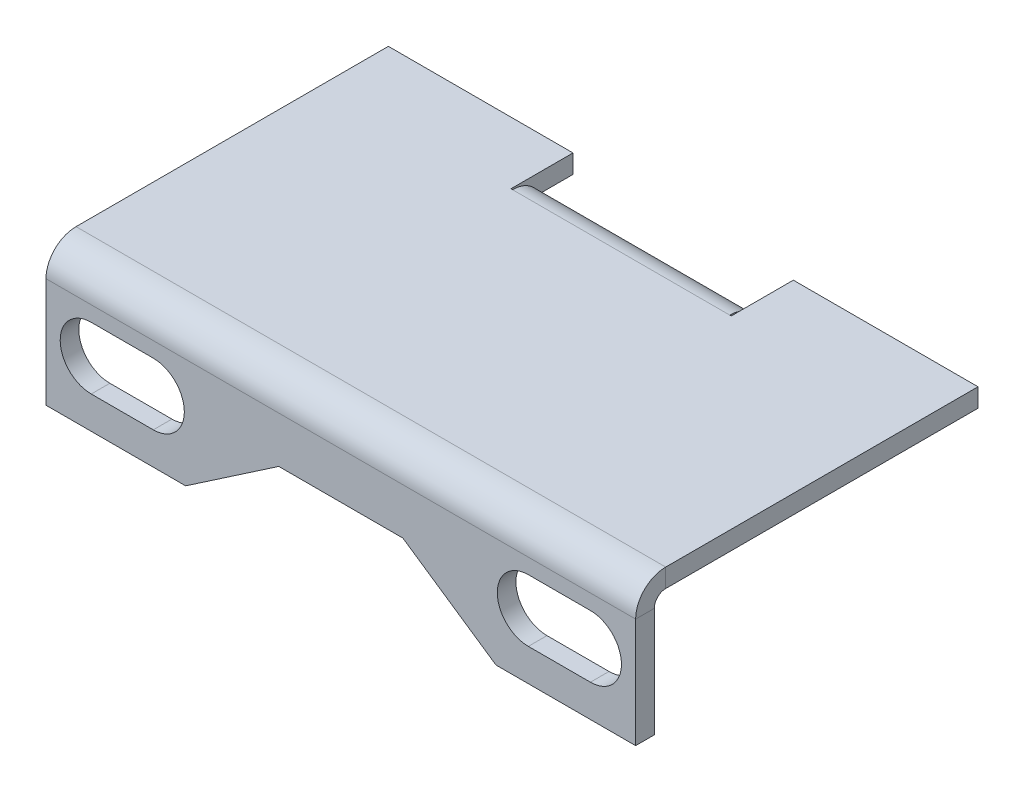
ISO-10303-21;
HEADER;
FILE_DESCRIPTION(('STEP AP214'),'2;1');
FILE_NAME('part.step','',(''),(''),'','','');
FILE_SCHEMA(('AUTOMOTIVE_DESIGN { 1 0 10303 214 1 1 1 1 }'));
ENDSEC;
DATA;
#1=APPLICATION_CONTEXT('core data for automotive mechanical design processes');
#2=APPLICATION_PROTOCOL_DEFINITION('international standard','automotive_design',2000,#1);
#3=PRODUCT_CONTEXT('',#1,'mechanical');
#4=PRODUCT('Part','Part','',(#3));
#5=PRODUCT_RELATED_PRODUCT_CATEGORY('part','',(#4));
#6=PRODUCT_DEFINITION_FORMATION('','',#4);
#7=PRODUCT_DEFINITION_CONTEXT('part definition',#1,'design');
#8=PRODUCT_DEFINITION('design','',#6,#7);
#9=PRODUCT_DEFINITION_SHAPE('','',#8);
#10=(LENGTH_UNIT() NAMED_UNIT(*) SI_UNIT(.MILLI.,.METRE.));
#11=(NAMED_UNIT(*) PLANE_ANGLE_UNIT() SI_UNIT($,.RADIAN.));
#12=(NAMED_UNIT(*) SI_UNIT($,.STERADIAN.) SOLID_ANGLE_UNIT());
#13=UNCERTAINTY_MEASURE_WITH_UNIT(LENGTH_MEASURE(1.E-05),#10,'distance_accuracy_value','');
#14=(GEOMETRIC_REPRESENTATION_CONTEXT(3) GLOBAL_UNCERTAINTY_ASSIGNED_CONTEXT((#13)) GLOBAL_UNIT_ASSIGNED_CONTEXT((#10,
#11,#12)) REPRESENTATION_CONTEXT('',''));
#15=CARTESIAN_POINT('',(0.,0.,0.));
#16=DIRECTION('',(0.,0.,1.));
#17=DIRECTION('',(1.,0.,0.));
#18=AXIS2_PLACEMENT_3D('',#15,#16,#17);
#19=CARTESIAN_POINT('',(19.,19.0000000000001,-20.));
#20=DIRECTION('',(-1.,0.,0.));
#21=DIRECTION('',(0.,0.,1.));
#22=AXIS2_PLACEMENT_3D('',#19,#20,#21);
#23=PLANE('',#22);
#24=DIRECTION('',(0.,0.,1.));
#25=VECTOR('',#24,1.);
#26=CARTESIAN_POINT('',(18.9999999999999,17.8000000000001,-20.));
#27=LINE('',#26,#25);
#28=CARTESIAN_POINT('',(18.9999999999999,17.8,-1.93659999999999));
#29=VERTEX_POINT('',#28);
#30=CARTESIAN_POINT('',(19.,17.8000000000001,-22.0634));
#31=VERTEX_POINT('',#30);
#32=EDGE_CURVE('E289',#29,#31,#27,.F.);
#33=ORIENTED_EDGE('',*,*,#32,.T.);
#34=DIRECTION('',(0.,1.,0.));
#35=VECTOR('',#34,1.);
#36=CARTESIAN_POINT('',(19.,5.24571786202021,-22.0634000000001));
#37=LINE('',#36,#35);
#38=CARTESIAN_POINT('',(19.,19.0000000000001,-22.0634));
#39=VERTEX_POINT('',#38);
#40=EDGE_CURVE('E292',#31,#39,#37,.T.);
#41=ORIENTED_EDGE('',*,*,#40,.T.);
#42=DIRECTION('',(0.,0.,-1.));
#43=VECTOR('',#42,1.);
#44=CARTESIAN_POINT('',(19.,19.,0.));
#45=LINE('',#44,#43);
#46=CARTESIAN_POINT('',(19.,19.,-1.93660000000001));
#47=VERTEX_POINT('',#46);
#48=EDGE_CURVE('E608',#47,#39,#45,.T.);
#49=ORIENTED_EDGE('',*,*,#48,.F.);
#50=DIRECTION('',(0.,1.,0.));
#51=VECTOR('',#50,1.);
#52=CARTESIAN_POINT('',(18.9999999999999,17.8,-1.93660000000001));
#53=LINE('',#52,#51);
#54=EDGE_CURVE('E295',#29,#47,#53,.T.);
#55=ORIENTED_EDGE('',*,*,#54,.F.);
#56=EDGE_LOOP('',(#33,#41,#49,#55));
#57=FACE_BOUND('',#56,.T.);
#58=ADVANCED_FACE('F92',(#57),#23,.F.);
#59=CARTESIAN_POINT('',(-19.,19.,-1.20000000000001));
#60=DIRECTION('',(1.,0.,0.));
#61=DIRECTION('',(0.,0.,-1.));
#62=AXIS2_PLACEMENT_3D('',#59,#60,#61);
#63=PLANE('',#62);
#64=DIRECTION('',(0.,0.,1.));
#65=VECTOR('',#64,1.);
#66=CARTESIAN_POINT('',(-19.,19.,0.));
#67=LINE('',#66,#65);
#68=CARTESIAN_POINT('',(-19.,19.0000000000001,-22.0634));
#69=VERTEX_POINT('',#68);
#70=CARTESIAN_POINT('',(-19.,19.,-1.93660000000001));
#71=VERTEX_POINT('',#70);
#72=EDGE_CURVE('E604',#69,#71,#67,.T.);
#73=ORIENTED_EDGE('',*,*,#72,.F.);
#74=DIRECTION('',(0.,1.,0.));
#75=VECTOR('',#74,1.);
#76=CARTESIAN_POINT('',(-19.0000000000001,5.24571786202021,-22.0634000000001));
#77=LINE('',#76,#75);
#78=CARTESIAN_POINT('',(-19.,17.8000000000001,-22.0634));
#79=VERTEX_POINT('',#78);
#80=EDGE_CURVE('E337',#79,#69,#77,.T.);
#81=ORIENTED_EDGE('',*,*,#80,.F.);
#82=DIRECTION('',(0.,0.,-1.));
#83=VECTOR('',#82,1.);
#84=CARTESIAN_POINT('',(-19.,17.8,-1.20000000000001));
#85=LINE('',#84,#83);
#86=CARTESIAN_POINT('',(-19.0000000000001,17.8,-1.93660000000001));
#87=VERTEX_POINT('',#86);
#88=EDGE_CURVE('E300',#79,#87,#85,.F.);
#89=ORIENTED_EDGE('',*,*,#88,.T.);
#90=DIRECTION('',(0.,1.,0.));
#91=VECTOR('',#90,1.);
#92=CARTESIAN_POINT('',(-19.,19.,-1.93660000000001));
#93=LINE('',#92,#91);
#94=EDGE_CURVE('E15',#87,#71,#93,.T.);
#95=ORIENTED_EDGE('',*,*,#94,.T.);
#96=EDGE_LOOP('',(#73,#81,#89,#95));
#97=FACE_BOUND('',#96,.T.);
#98=ADVANCED_FACE('F702',(#97),#63,.F.);
#99=CARTESIAN_POINT('',(0.,19.,0.));
#100=DIRECTION('',(0.,-1.,0.));
#101=DIRECTION('',(0.,0.,-1.));
#102=AXIS2_PLACEMENT_3D('',#99,#100,#101);
#103=PLANE('',#102);
#104=ORIENTED_EDGE('',*,*,#48,.T.);
#105=DIRECTION('',(-1.,0.,0.));
#106=VECTOR('',#105,1.);
#107=CARTESIAN_POINT('',(19.,19.0000000000001,-22.0634));
#108=LINE('',#107,#106);
#109=CARTESIAN_POINT('',(7.1,19.0000000000001,-22.0634));
#110=VERTEX_POINT('',#109);
#111=EDGE_CURVE('E313',#39,#110,#108,.T.);
#112=ORIENTED_EDGE('',*,*,#111,.T.);
#113=DIRECTION('',(0.,0.,1.));
#114=VECTOR('',#113,1.);
#115=CARTESIAN_POINT('',(7.1,19.,-18.0634));
#116=LINE('',#115,#114);
#117=CARTESIAN_POINT('',(7.1,19.,-18.0634));
#118=VERTEX_POINT('',#117);
#119=EDGE_CURVE('E315',#110,#118,#116,.T.);
#120=ORIENTED_EDGE('',*,*,#119,.T.);
#121=DIRECTION('',(-1.,0.,0.));
#122=VECTOR('',#121,1.);
#123=CARTESIAN_POINT('',(19.,19.,-18.0634));
#124=LINE('',#123,#122);
#125=CARTESIAN_POINT('',(6.99999999999999,19.,-18.0634));
#126=VERTEX_POINT('',#125);
#127=EDGE_CURVE('E618',#118,#126,#124,.T.);
#128=ORIENTED_EDGE('',*,*,#127,.T.);
#129=DIRECTION('',(-1.,0.,0.));
#130=VECTOR('',#129,1.);
#131=CARTESIAN_POINT('',(19.,19.,-18.0634));
#132=LINE('',#131,#130);
#133=CARTESIAN_POINT('',(-7.,19.0000000000001,-18.0634));
#134=VERTEX_POINT('',#133);
#135=EDGE_CURVE('E621',#126,#134,#132,.T.);
#136=ORIENTED_EDGE('',*,*,#135,.T.);
#137=DIRECTION('',(1.,0.,0.));
#138=VECTOR('',#137,1.);
#139=CARTESIAN_POINT('',(-19.,19.,-18.0634));
#140=LINE('',#139,#138);
#141=CARTESIAN_POINT('',(-7.1,19.,-18.0634));
#142=VERTEX_POINT('',#141);
#143=EDGE_CURVE('E301',#142,#134,#140,.T.);
#144=ORIENTED_EDGE('',*,*,#143,.F.);
#145=DIRECTION('',(0.,0.,-1.));
#146=VECTOR('',#145,1.);
#147=CARTESIAN_POINT('',(-7.1,19.,-18.0634));
#148=LINE('',#147,#146);
#149=CARTESIAN_POINT('',(-7.1,19.0000000000001,-22.0634));
#150=VERTEX_POINT('',#149);
#151=EDGE_CURVE('E328',#142,#150,#148,.T.);
#152=ORIENTED_EDGE('',*,*,#151,.T.);
#153=DIRECTION('',(-1.,0.,0.));
#154=VECTOR('',#153,1.);
#155=CARTESIAN_POINT('',(-19.,19.0000000000001,-22.0634));
#156=LINE('',#155,#154);
#157=EDGE_CURVE('E323',#150,#69,#156,.T.);
#158=ORIENTED_EDGE('',*,*,#157,.T.);
#159=ORIENTED_EDGE('',*,*,#72,.T.);
#160=DIRECTION('',(-1.,0.,0.));
#161=VECTOR('',#160,1.);
#162=CARTESIAN_POINT('',(-19.,19.,-1.93660000000001));
#163=LINE('',#162,#161);
#164=EDGE_CURVE('E100',#47,#71,#163,.T.);
#165=ORIENTED_EDGE('',*,*,#164,.F.);
#166=EDGE_LOOP('',(#104,#112,#120,#128,#136,#144,#152,#158,#159,#165));
#167=FACE_BOUND('',#166,.T.);
#168=ADVANCED_FACE('F706',(#167),#103,.F.);
#169=CARTESIAN_POINT('',(0.,17.8,0.));
#170=DIRECTION('',(0.,-1.,0.));
#171=DIRECTION('',(0.,0.,-1.));
#172=AXIS2_PLACEMENT_3D('',#169,#170,#171);
#173=PLANE('',#172);
#174=ORIENTED_EDGE('',*,*,#88,.F.);
#175=DIRECTION('',(-1.,0.,0.));
#176=VECTOR('',#175,1.);
#177=CARTESIAN_POINT('',(-19.,17.8000000000001,-22.0634));
#178=LINE('',#177,#176);
#179=CARTESIAN_POINT('',(-7.1,17.8000000000001,-22.0634000000001));
#180=VERTEX_POINT('',#179);
#181=EDGE_CURVE('E333',#180,#79,#178,.T.);
#182=ORIENTED_EDGE('',*,*,#181,.F.);
#183=DIRECTION('',(0.,0.,-1.));
#184=VECTOR('',#183,1.);
#185=CARTESIAN_POINT('',(-7.1,17.8000000000001,-18.0634));
#186=LINE('',#185,#184);
#187=CARTESIAN_POINT('',(-7.1,17.8,-18.0634));
#188=VERTEX_POINT('',#187);
#189=EDGE_CURVE('E339',#188,#180,#186,.T.);
#190=ORIENTED_EDGE('',*,*,#189,.F.);
#191=DIRECTION('',(-1.,0.,0.));
#192=VECTOR('',#191,1.);
#193=CARTESIAN_POINT('',(-19.0000000000001,17.8,-18.0634));
#194=LINE('',#193,#192);
#195=CARTESIAN_POINT('',(-7.,17.8,-18.0634));
#196=VERTEX_POINT('',#195);
#197=EDGE_CURVE('E115',#196,#188,#194,.T.);
#198=ORIENTED_EDGE('',*,*,#197,.F.);
#199=DIRECTION('',(-1.,0.,0.));
#200=VECTOR('',#199,1.);
#201=CARTESIAN_POINT('',(18.9999999999999,17.8000000000001,-18.0634));
#202=LINE('',#201,#200);
#203=CARTESIAN_POINT('',(6.99999999999999,17.8,-18.0634));
#204=VERTEX_POINT('',#203);
#205=EDGE_CURVE('E613',#204,#196,#202,.T.);
#206=ORIENTED_EDGE('',*,*,#205,.F.);
#207=DIRECTION('',(-1.,0.,0.));
#208=VECTOR('',#207,1.);
#209=CARTESIAN_POINT('',(18.9999999999999,17.8000000000001,-18.0634));
#210=LINE('',#209,#208);
#211=CARTESIAN_POINT('',(7.1,17.8000000000001,-18.0634));
#212=VERTEX_POINT('',#211);
#213=EDGE_CURVE('E607',#212,#204,#210,.T.);
#214=ORIENTED_EDGE('',*,*,#213,.F.);
#215=DIRECTION('',(0.,0.,1.));
#216=VECTOR('',#215,1.);
#217=CARTESIAN_POINT('',(7.1,17.8000000000001,-18.0634));
#218=LINE('',#217,#216);
#219=CARTESIAN_POINT('',(7.1,17.8000000000001,-22.0634));
#220=VERTEX_POINT('',#219);
#221=EDGE_CURVE('E107',#220,#212,#218,.T.);
#222=ORIENTED_EDGE('',*,*,#221,.F.);
#223=DIRECTION('',(-1.,0.,0.));
#224=VECTOR('',#223,1.);
#225=CARTESIAN_POINT('',(19.,17.8000000000001,-22.0634));
#226=LINE('',#225,#224);
#227=EDGE_CURVE('E304',#31,#220,#226,.T.);
#228=ORIENTED_EDGE('',*,*,#227,.F.);
#229=ORIENTED_EDGE('',*,*,#32,.F.);
#230=DIRECTION('',(1.,0.,0.));
#231=VECTOR('',#230,1.);
#232=CARTESIAN_POINT('',(-19.0000000000001,17.8,-1.93660000000001));
#233=LINE('',#232,#231);
#234=EDGE_CURVE('E629',#87,#29,#233,.T.);
#235=ORIENTED_EDGE('',*,*,#234,.F.);
#236=EDGE_LOOP('',(#174,#182,#190,#198,#206,#214,#222,#228,#229,#235));
#237=FACE_BOUND('',#236,.T.);
#238=ADVANCED_FACE('F305',(#237),#173,.T.);
#239=CARTESIAN_POINT('',(-19.,32.4900578741123,-18.0633999999999));
#240=DIRECTION('',(0.,0.,1.));
#241=DIRECTION('',(0.,-1.,0.));
#242=AXIS2_PLACEMENT_3D('',#239,#240,#241);
#243=PLANE('',#242);
#244=ORIENTED_EDGE('',*,*,#197,.T.);
#245=DIRECTION('',(0.,1.,0.));
#246=VECTOR('',#245,1.);
#247=CARTESIAN_POINT('',(-7.1,5.24571786202019,-18.0634000000001));
#248=LINE('',#247,#246);
#249=EDGE_CURVE('E327',#188,#142,#248,.T.);
#250=ORIENTED_EDGE('',*,*,#249,.T.);
#251=ORIENTED_EDGE('',*,*,#143,.T.);
#252=DIRECTION('',(0.,-1.,0.));
#253=VECTOR('',#252,1.);
#254=CARTESIAN_POINT('',(-7.00000000000002,32.4900578741123,-18.0633999999999));
#255=LINE('',#254,#253);
#256=EDGE_CURVE('E617',#134,#196,#255,.T.);
#257=ORIENTED_EDGE('',*,*,#256,.T.);
#258=EDGE_LOOP('',(#244,#250,#251,#257));
#259=FACE_BOUND('',#258,.T.);
#260=ADVANCED_FACE('F714',(#259),#243,.F.);
#261=CARTESIAN_POINT('',(6.99999999999998,32.4900578741123,-18.0633999999999));
#262=DIRECTION('',(0.,0.,1.));
#263=DIRECTION('',(0.,-1.,0.));
#264=AXIS2_PLACEMENT_3D('',#261,#262,#263);
#265=PLANE('',#264);
#266=ORIENTED_EDGE('',*,*,#127,.F.);
#267=DIRECTION('',(0.,1.,0.));
#268=VECTOR('',#267,1.);
#269=CARTESIAN_POINT('',(7.1,5.24571786202019,-18.0634000000001));
#270=LINE('',#269,#268);
#271=EDGE_CURVE('E332',#212,#118,#270,.T.);
#272=ORIENTED_EDGE('',*,*,#271,.F.);
#273=ORIENTED_EDGE('',*,*,#213,.T.);
#274=DIRECTION('',(0.,-1.,0.));
#275=VECTOR('',#274,1.);
#276=CARTESIAN_POINT('',(6.99999999999998,32.4900578741123,-18.0633999999999));
#277=LINE('',#276,#275);
#278=EDGE_CURVE('E625',#126,#204,#277,.T.);
#279=ORIENTED_EDGE('',*,*,#278,.F.);
#280=EDGE_LOOP('',(#266,#272,#273,#279));
#281=FACE_BOUND('',#280,.T.);
#282=ADVANCED_FACE('F718',(#281),#265,.F.);
#283=CARTESIAN_POINT('',(6.99999999999999,17.0634000000001,-18.0634));
#284=DIRECTION('',(-1.,0.,0.));
#285=DIRECTION('',(0.,1.,0.));
#286=AXIS2_PLACEMENT_3D('',#283,#284,#285);
#287=PLANE('',#286);
#288=DIRECTION('',(0.,0.,-1.));
#289=VECTOR('',#288,1.);
#290=CARTESIAN_POINT('',(7.00000000000001,17.0634,-18.8));
#291=LINE('',#290,#289);
#292=CARTESIAN_POINT('',(7.00000000000001,17.0634,-18.8));
#293=VERTEX_POINT('',#292);
#294=CARTESIAN_POINT('',(6.99999999999999,17.0634,-20.));
#295=VERTEX_POINT('',#294);
#296=EDGE_CURVE('E578',#293,#295,#291,.T.);
#297=ORIENTED_EDGE('',*,*,#296,.T.);
#298=CARTESIAN_POINT('',(6.99999999999998,17.0634000000001,-18.0634));
#299=DIRECTION('',(1.,0.,0.));
#300=DIRECTION('',(0.,-1.,0.));
#301=AXIS2_PLACEMENT_3D('',#298,#299,#300);
#302=CIRCLE('',#301,1.9366);
#303=EDGE_CURVE('E544',#295,#126,#302,.T.);
#304=ORIENTED_EDGE('',*,*,#303,.T.);
#305=ORIENTED_EDGE('',*,*,#278,.T.);
#306=CARTESIAN_POINT('',(6.99999999999999,17.0634000000001,-18.0634));
#307=DIRECTION('',(1.,0.,0.));
#308=DIRECTION('',(0.,1.,0.));
#309=AXIS2_PLACEMENT_3D('',#306,#307,#308);
#310=CIRCLE('',#309,0.736599999999998);
#311=EDGE_CURVE('E585',#293,#204,#310,.T.);
#312=ORIENTED_EDGE('',*,*,#311,.F.);
#313=EDGE_LOOP('',(#297,#304,#305,#312));
#314=FACE_BOUND('',#313,.T.);
#315=ADVANCED_FACE('F721',(#314),#287,.F.);
#316=CARTESIAN_POINT('',(-7.,17.0634000000001,-18.0634));
#317=DIRECTION('',(1.,0.,0.));
#318=DIRECTION('',(0.,-1.,0.));
#319=AXIS2_PLACEMENT_3D('',#316,#317,#318);
#320=PLANE('',#319);
#321=ORIENTED_EDGE('',*,*,#256,.F.);
#322=CARTESIAN_POINT('',(-7.00000000000001,17.0634000000001,-18.0634));
#323=DIRECTION('',(1.,0.,0.));
#324=DIRECTION('',(0.,-1.,0.));
#325=AXIS2_PLACEMENT_3D('',#322,#323,#324);
#326=CIRCLE('',#325,1.9366);
#327=CARTESIAN_POINT('',(-7.,17.0634,-20.));
#328=VERTEX_POINT('',#327);
#329=EDGE_CURVE('E590',#134,#328,#326,.F.);
#330=ORIENTED_EDGE('',*,*,#329,.T.);
#331=DIRECTION('',(0.,0.,1.));
#332=VECTOR('',#331,1.);
#333=CARTESIAN_POINT('',(-7.,17.0634,-20.));
#334=LINE('',#333,#332);
#335=CARTESIAN_POINT('',(-6.99999999999999,17.0634,-18.8));
#336=VERTEX_POINT('',#335);
#337=EDGE_CURVE('E570',#328,#336,#334,.T.);
#338=ORIENTED_EDGE('',*,*,#337,.T.);
#339=CARTESIAN_POINT('',(-7.,17.0634000000001,-18.0634));
#340=DIRECTION('',(-1.,0.,0.));
#341=DIRECTION('',(0.,-1.,0.));
#342=AXIS2_PLACEMENT_3D('',#339,#340,#341);
#343=CIRCLE('',#342,0.736599999999998);
#344=EDGE_CURVE('E589',#196,#336,#343,.T.);
#345=ORIENTED_EDGE('',*,*,#344,.F.);
#346=EDGE_LOOP('',(#321,#330,#338,#345));
#347=FACE_BOUND('',#346,.T.);
#348=ADVANCED_FACE('F725',(#347),#320,.F.);
#349=CARTESIAN_POINT('',(-14.2073224423176,17.0634000000001,-18.0634));
#350=DIRECTION('',(1.,0.,0.));
#351=DIRECTION('',(0.,-1.,0.));
#352=AXIS2_PLACEMENT_3D('',#349,#350,#351);
#353=CYLINDRICAL_SURFACE('',#352,0.7366);
#354=ORIENTED_EDGE('',*,*,#344,.T.);
#355=DIRECTION('',(1.,0.,0.));
#356=VECTOR('',#355,1.);
#357=CARTESIAN_POINT('',(-19.,17.0634,-18.8));
#358=LINE('',#357,#356);
#359=EDGE_CURVE('E370',#336,#293,#358,.T.);
#360=ORIENTED_EDGE('',*,*,#359,.T.);
#361=ORIENTED_EDGE('',*,*,#311,.T.);
#362=ORIENTED_EDGE('',*,*,#205,.T.);
#363=EDGE_LOOP('',(#354,#360,#361,#362));
#364=FACE_BOUND('',#363,.T.);
#365=ADVANCED_FACE('F729',(#364),#353,.F.);
#366=CARTESIAN_POINT('',(-14.2073224423176,17.0634000000001,-18.0634));
#367=DIRECTION('',(1.,0.,0.));
#368=DIRECTION('',(0.,-1.,0.));
#369=AXIS2_PLACEMENT_3D('',#366,#367,#368);
#370=CYLINDRICAL_SURFACE('',#369,1.9366);
#371=ORIENTED_EDGE('',*,*,#329,.F.);
#372=ORIENTED_EDGE('',*,*,#135,.F.);
#373=ORIENTED_EDGE('',*,*,#303,.F.);
#374=DIRECTION('',(-1.,0.,0.));
#375=VECTOR('',#374,1.);
#376=CARTESIAN_POINT('',(-19.,17.0634,-20.));
#377=LINE('',#376,#375);
#378=EDGE_CURVE('E574',#295,#328,#377,.T.);
#379=ORIENTED_EDGE('',*,*,#378,.T.);
#380=EDGE_LOOP('',(#371,#372,#373,#379));
#381=FACE_BOUND('',#380,.T.);
#382=ADVANCED_FACE('F731',(#381),#370,.T.);
#383=CARTESIAN_POINT('',(-19.,13.,-20.));
#384=DIRECTION('',(0.,1.,0.));
#385=DIRECTION('',(0.,0.,1.));
#386=AXIS2_PLACEMENT_3D('',#383,#384,#385);
#387=PLANE('',#386);
#388=DIRECTION('',(-1.,0.,0.));
#389=VECTOR('',#388,1.);
#390=CARTESIAN_POINT('',(0.,13.,-20.));
#391=LINE('',#390,#389);
#392=CARTESIAN_POINT('',(6.99999999999998,13.,-20.));
#393=VERTEX_POINT('',#392);
#394=CARTESIAN_POINT('',(-7.00000000000002,13.,-20.));
#395=VERTEX_POINT('',#394);
#396=EDGE_CURVE('E551',#393,#395,#391,.T.);
#397=ORIENTED_EDGE('',*,*,#396,.F.);
#398=DIRECTION('',(0.,0.,1.));
#399=VECTOR('',#398,1.);
#400=CARTESIAN_POINT('',(6.99999999999999,13.0000000000001,-33.4900578741123));
#401=LINE('',#400,#399);
#402=CARTESIAN_POINT('',(6.99999999999999,13.,-18.8000000000001));
#403=VERTEX_POINT('',#402);
#404=EDGE_CURVE('E566',#393,#403,#401,.T.);
#405=ORIENTED_EDGE('',*,*,#404,.T.);
#406=DIRECTION('',(1.,0.,0.));
#407=VECTOR('',#406,1.);
#408=CARTESIAN_POINT('',(-19.,13.,-18.8000000000001));
#409=LINE('',#408,#407);
#410=CARTESIAN_POINT('',(-7.,13.,-18.8000000000001));
#411=VERTEX_POINT('',#410);
#412=EDGE_CURVE('E562',#403,#411,#409,.F.);
#413=ORIENTED_EDGE('',*,*,#412,.T.);
#414=DIRECTION('',(0.,0.,1.));
#415=VECTOR('',#414,1.);
#416=CARTESIAN_POINT('',(-7.,13.0000000000001,-33.4900578741123));
#417=LINE('',#416,#415);
#418=EDGE_CURVE('E559',#395,#411,#417,.T.);
#419=ORIENTED_EDGE('',*,*,#418,.F.);
#420=EDGE_LOOP('',(#397,#405,#413,#419));
#421=FACE_BOUND('',#420,.T.);
#422=ADVANCED_FACE('F734',(#421),#387,.F.);
#423=CARTESIAN_POINT('',(0.,1.11022302462516E-13,-18.8000000000001));
#424=DIRECTION('',(0.,0.,1.));
#425=DIRECTION('',(0.,-1.,0.));
#426=AXIS2_PLACEMENT_3D('',#423,#424,#425);
#427=PLANE('',#426);
#428=DIRECTION('',(0.,-1.,0.));
#429=VECTOR('',#428,1.);
#430=CARTESIAN_POINT('',(6.99999999999999,13.,-18.8000000000001));
#431=LINE('',#430,#429);
#432=EDGE_CURVE('E545',#293,#403,#431,.T.);
#433=ORIENTED_EDGE('',*,*,#432,.F.);
#434=ORIENTED_EDGE('',*,*,#359,.F.);
#435=DIRECTION('',(0.,1.,0.));
#436=VECTOR('',#435,1.);
#437=CARTESIAN_POINT('',(-6.99999999999999,19.1629263703941,-18.8));
#438=LINE('',#437,#436);
#439=EDGE_CURVE('E555',#411,#336,#438,.T.);
#440=ORIENTED_EDGE('',*,*,#439,.F.);
#441=ORIENTED_EDGE('',*,*,#412,.F.);
#442=EDGE_LOOP('',(#433,#434,#440,#441));
#443=FACE_BOUND('',#442,.T.);
#444=ADVANCED_FACE('F750',(#443),#427,.T.);
#445=CARTESIAN_POINT('',(-7.,19.1629263703942,-33.4900578741123));
#446=DIRECTION('',(1.,0.,0.));
#447=DIRECTION('',(0.,0.,1.));
#448=AXIS2_PLACEMENT_3D('',#445,#446,#447);
#449=PLANE('',#448);
#450=ORIENTED_EDGE('',*,*,#337,.F.);
#451=DIRECTION('',(0.,1.,0.));
#452=VECTOR('',#451,1.);
#453=CARTESIAN_POINT('',(-7.,1.21430643318376E-13,-20.0000000000001));
#454=LINE('',#453,#452);
#455=EDGE_CURVE('E548',#395,#328,#454,.T.);
#456=ORIENTED_EDGE('',*,*,#455,.F.);
#457=ORIENTED_EDGE('',*,*,#418,.T.);
#458=ORIENTED_EDGE('',*,*,#439,.T.);
#459=EDGE_LOOP('',(#450,#456,#457,#458));
#460=FACE_BOUND('',#459,.T.);
#461=ADVANCED_FACE('F746',(#460),#449,.F.);
#462=CARTESIAN_POINT('',(0.,1.21430643318376E-13,-20.0000000000001));
#463=DIRECTION('',(0.,0.,1.));
#464=DIRECTION('',(0.,-1.,0.));
#465=AXIS2_PLACEMENT_3D('',#462,#463,#464);
#466=PLANE('',#465);
#467=ORIENTED_EDGE('',*,*,#378,.F.);
#468=DIRECTION('',(0.,1.,0.));
#469=VECTOR('',#468,1.);
#470=CARTESIAN_POINT('',(6.99999999999998,13.0000000000001,-20.));
#471=LINE('',#470,#469);
#472=EDGE_CURVE('E541',#393,#295,#471,.T.);
#473=ORIENTED_EDGE('',*,*,#472,.F.);
#474=ORIENTED_EDGE('',*,*,#396,.T.);
#475=ORIENTED_EDGE('',*,*,#455,.T.);
#476=EDGE_LOOP('',(#467,#473,#474,#475));
#477=FACE_BOUND('',#476,.T.);
#478=ADVANCED_FACE('F742',(#477),#466,.F.);
#479=CARTESIAN_POINT('',(6.99999999999999,13.0000000000001,-33.4900578741123));
#480=DIRECTION('',(-1.,0.,0.));
#481=DIRECTION('',(0.,0.,-1.));
#482=AXIS2_PLACEMENT_3D('',#479,#480,#481);
#483=PLANE('',#482);
#484=ORIENTED_EDGE('',*,*,#296,.F.);
#485=ORIENTED_EDGE('',*,*,#432,.T.);
#486=ORIENTED_EDGE('',*,*,#404,.F.);
#487=ORIENTED_EDGE('',*,*,#472,.T.);
#488=EDGE_LOOP('',(#484,#485,#486,#487));
#489=FACE_BOUND('',#488,.T.);
#490=ADVANCED_FACE('F739',(#489),#483,.F.);
#491=CARTESIAN_POINT('',(-19.,10.,-1.2));
#492=DIRECTION('',(0.,-1.,0.));
#493=DIRECTION('',(0.,0.,-1.));
#494=AXIS2_PLACEMENT_3D('',#491,#492,#493);
#495=PLANE('',#494);
#496=DIRECTION('',(1.,0.,0.));
#497=VECTOR('',#496,1.);
#498=CARTESIAN_POINT('',(-19.,10.,0.));
#499=LINE('',#498,#497);
#500=CARTESIAN_POINT('',(-19.,10.,0.));
#501=VERTEX_POINT('',#500);
#502=CARTESIAN_POINT('',(-10.,10.,0.));
#503=VERTEX_POINT('',#502);
#504=EDGE_CURVE('E390',#501,#503,#499,.T.);
#505=ORIENTED_EDGE('',*,*,#504,.F.);
#506=DIRECTION('',(0.,0.,1.));
#507=VECTOR('',#506,1.);
#508=CARTESIAN_POINT('',(-19.,10.,-1.2));
#509=LINE('',#508,#507);
#510=CARTESIAN_POINT('',(-19.,10.,-1.2));
#511=VERTEX_POINT('',#510);
#512=EDGE_CURVE('E366',#511,#501,#509,.T.);
#513=ORIENTED_EDGE('',*,*,#512,.F.);
#514=DIRECTION('',(1.,0.,0.));
#515=VECTOR('',#514,1.);
#516=CARTESIAN_POINT('',(-19.,10.,-1.2));
#517=LINE('',#516,#515);
#518=CARTESIAN_POINT('',(-10.,10.,-1.2));
#519=VERTEX_POINT('',#518);
#520=EDGE_CURVE('E532',#511,#519,#517,.T.);
#521=ORIENTED_EDGE('',*,*,#520,.T.);
#522=DIRECTION('',(0.,0.,1.));
#523=VECTOR('',#522,1.);
#524=CARTESIAN_POINT('',(-10.,10.,-1.2));
#525=LINE('',#524,#523);
#526=EDGE_CURVE('E529',#519,#503,#525,.T.);
#527=ORIENTED_EDGE('',*,*,#526,.T.);
#528=EDGE_LOOP('',(#505,#513,#521,#527));
#529=FACE_BOUND('',#528,.T.);
#530=ADVANCED_FACE('F677',(#529),#495,.T.);
#531=CARTESIAN_POINT('',(-10.,10.,-1.2));
#532=DIRECTION('',(0.562780962996727,-0.826606065601068,0.));
#533=DIRECTION('',(0.826606065601068,0.562780962996727,0.));
#534=AXIS2_PLACEMENT_3D('',#531,#532,#533);
#535=PLANE('',#534);
#536=DIRECTION('',(0.826606065601068,0.562780962996727,0.));
#537=VECTOR('',#536,1.);
#538=CARTESIAN_POINT('',(-10.,10.,0.));
#539=LINE('',#538,#537);
#540=CARTESIAN_POINT('',(-3.99999999999999,14.085,0.));
#541=VERTEX_POINT('',#540);
#542=EDGE_CURVE('E386',#503,#541,#539,.T.);
#543=ORIENTED_EDGE('',*,*,#542,.F.);
#544=ORIENTED_EDGE('',*,*,#526,.F.);
#545=DIRECTION('',(0.826606065601068,0.562780962996727,0.));
#546=VECTOR('',#545,1.);
#547=CARTESIAN_POINT('',(-10.,10.,-1.2));
#548=LINE('',#547,#546);
#549=CARTESIAN_POINT('',(-3.99999999999999,14.085,-1.2));
#550=VERTEX_POINT('',#549);
#551=EDGE_CURVE('E525',#519,#550,#548,.T.);
#552=ORIENTED_EDGE('',*,*,#551,.T.);
#553=DIRECTION('',(0.,0.,1.));
#554=VECTOR('',#553,1.);
#555=CARTESIAN_POINT('',(-3.99999999999999,14.085,-1.2));
#556=LINE('',#555,#554);
#557=EDGE_CURVE('E522',#550,#541,#556,.T.);
#558=ORIENTED_EDGE('',*,*,#557,.T.);
#559=EDGE_LOOP('',(#543,#544,#552,#558));
#560=FACE_BOUND('',#559,.T.);
#561=ADVANCED_FACE('F681',(#560),#535,.T.);
#562=CARTESIAN_POINT('',(4.00000000000001,14.085,-1.2));
#563=DIRECTION('',(0.,-1.,0.));
#564=DIRECTION('',(0.,0.,-1.));
#565=AXIS2_PLACEMENT_3D('',#562,#563,#564);
#566=PLANE('',#565);
#567=DIRECTION('',(1.,0.,0.));
#568=VECTOR('',#567,1.);
#569=CARTESIAN_POINT('',(4.00000000000001,14.085,0.));
#570=LINE('',#569,#568);
#571=CARTESIAN_POINT('',(4.00000000000001,14.085,0.));
#572=VERTEX_POINT('',#571);
#573=EDGE_CURVE('E382',#541,#572,#570,.T.);
#574=ORIENTED_EDGE('',*,*,#573,.F.);
#575=ORIENTED_EDGE('',*,*,#557,.F.);
#576=DIRECTION('',(1.,0.,0.));
#577=VECTOR('',#576,1.);
#578=CARTESIAN_POINT('',(4.00000000000001,14.085,-1.2));
#579=LINE('',#578,#577);
#580=CARTESIAN_POINT('',(4.00000000000001,14.085,-1.2));
#581=VERTEX_POINT('',#580);
#582=EDGE_CURVE('E518',#550,#581,#579,.T.);
#583=ORIENTED_EDGE('',*,*,#582,.T.);
#584=DIRECTION('',(0.,0.,1.));
#585=VECTOR('',#584,1.);
#586=CARTESIAN_POINT('',(4.00000000000001,14.085,-1.2));
#587=LINE('',#586,#585);
#588=EDGE_CURVE('E515',#581,#572,#587,.T.);
#589=ORIENTED_EDGE('',*,*,#588,.T.);
#590=EDGE_LOOP('',(#574,#575,#583,#589));
#591=FACE_BOUND('',#590,.T.);
#592=ADVANCED_FACE('F683',(#591),#566,.T.);
#593=CARTESIAN_POINT('',(4.00000000000001,14.085,-1.2));
#594=DIRECTION('',(-0.562780962996727,-0.826606065601067,0.));
#595=DIRECTION('',(0.826606065601068,-0.562780962996728,0.));
#596=AXIS2_PLACEMENT_3D('',#593,#594,#595);
#597=PLANE('',#596);
#598=DIRECTION('',(0.826606065601067,-0.562780962996727,0.));
#599=VECTOR('',#598,1.);
#600=CARTESIAN_POINT('',(4.00000000000001,14.085,0.));
#601=LINE('',#600,#599);
#602=CARTESIAN_POINT('',(9.99999999999999,10.,0.));
#603=VERTEX_POINT('',#602);
#604=EDGE_CURVE('E378',#572,#603,#601,.T.);
#605=ORIENTED_EDGE('',*,*,#604,.F.);
#606=ORIENTED_EDGE('',*,*,#588,.F.);
#607=DIRECTION('',(0.826606065601067,-0.562780962996727,0.));
#608=VECTOR('',#607,1.);
#609=CARTESIAN_POINT('',(4.00000000000001,14.085,-1.2));
#610=LINE('',#609,#608);
#611=CARTESIAN_POINT('',(9.99999999999999,10.,-1.2));
#612=VERTEX_POINT('',#611);
#613=EDGE_CURVE('E511',#581,#612,#610,.T.);
#614=ORIENTED_EDGE('',*,*,#613,.T.);
#615=DIRECTION('',(0.,0.,1.));
#616=VECTOR('',#615,1.);
#617=CARTESIAN_POINT('',(9.99999999999999,10.,-1.2));
#618=LINE('',#617,#616);
#619=EDGE_CURVE('E508',#612,#603,#618,.T.);
#620=ORIENTED_EDGE('',*,*,#619,.T.);
#621=EDGE_LOOP('',(#605,#606,#614,#620));
#622=FACE_BOUND('',#621,.T.);
#623=ADVANCED_FACE('F687',(#622),#597,.T.);
#624=CARTESIAN_POINT('',(9.99999999999999,10.,-1.2));
#625=DIRECTION('',(0.,-1.,0.));
#626=DIRECTION('',(1.,0.,0.));
#627=AXIS2_PLACEMENT_3D('',#624,#625,#626);
#628=PLANE('',#627);
#629=DIRECTION('',(1.,0.,0.));
#630=VECTOR('',#629,1.);
#631=CARTESIAN_POINT('',(9.99999999999999,10.,0.));
#632=LINE('',#631,#630);
#633=CARTESIAN_POINT('',(19.,10.,0.));
#634=VERTEX_POINT('',#633);
#635=EDGE_CURVE('E374',#603,#634,#632,.T.);
#636=ORIENTED_EDGE('',*,*,#635,.F.);
#637=ORIENTED_EDGE('',*,*,#619,.F.);
#638=DIRECTION('',(1.,0.,0.));
#639=VECTOR('',#638,1.);
#640=CARTESIAN_POINT('',(9.99999999999999,10.,-1.2));
#641=LINE('',#640,#639);
#642=CARTESIAN_POINT('',(19.,10.,-1.2));
#643=VERTEX_POINT('',#642);
#644=EDGE_CURVE('E504',#612,#643,#641,.T.);
#645=ORIENTED_EDGE('',*,*,#644,.T.);
#646=DIRECTION('',(0.,0.,1.));
#647=VECTOR('',#646,1.);
#648=CARTESIAN_POINT('',(19.,10.,-1.2));
#649=LINE('',#648,#647);
#650=EDGE_CURVE('E501',#643,#634,#649,.T.);
#651=ORIENTED_EDGE('',*,*,#650,.T.);
#652=EDGE_LOOP('',(#636,#637,#645,#651));
#653=FACE_BOUND('',#652,.T.);
#654=ADVANCED_FACE('F689',(#653),#628,.T.);
#655=CARTESIAN_POINT('',(16.085,14.085,-1.2));
#656=DIRECTION('',(0.,0.,1.));
#657=DIRECTION('',(1.,0.,0.));
#658=AXIS2_PLACEMENT_3D('',#655,#656,#657);
#659=CYLINDRICAL_SURFACE('',#658,2.);
#660=CARTESIAN_POINT('',(16.085,14.085,0.));
#661=DIRECTION('',(0.,0.,1.));
#662=DIRECTION('',(1.,0.,0.));
#663=AXIS2_PLACEMENT_3D('',#660,#661,#662);
#664=CIRCLE('',#663,2.);
#665=CARTESIAN_POINT('',(16.085,12.085,0.));
#666=VERTEX_POINT('',#665);
#667=CARTESIAN_POINT('',(16.085,16.085,0.));
#668=VERTEX_POINT('',#667);
#669=EDGE_CURVE('E497',#666,#668,#664,.T.);
#670=ORIENTED_EDGE('',*,*,#669,.T.);
#671=DIRECTION('',(0.,0.,1.));
#672=VECTOR('',#671,1.);
#673=CARTESIAN_POINT('',(16.085,16.085,-1.2));
#674=LINE('',#673,#672);
#675=CARTESIAN_POINT('',(16.085,16.085,-1.2));
#676=VERTEX_POINT('',#675);
#677=EDGE_CURVE('E473',#676,#668,#674,.T.);
#678=ORIENTED_EDGE('',*,*,#677,.F.);
#679=CARTESIAN_POINT('',(16.085,14.085,-1.2));
#680=DIRECTION('',(0.,0.,1.));
#681=DIRECTION('',(1.,0.,0.));
#682=AXIS2_PLACEMENT_3D('',#679,#680,#681);
#683=CIRCLE('',#682,2.);
#684=CARTESIAN_POINT('',(16.085,12.085,-1.2));
#685=VERTEX_POINT('',#684);
#686=EDGE_CURVE('E413',#685,#676,#683,.T.);
#687=ORIENTED_EDGE('',*,*,#686,.F.);
#688=DIRECTION('',(0.,0.,1.));
#689=VECTOR('',#688,1.);
#690=CARTESIAN_POINT('',(16.085,12.085,-1.2));
#691=LINE('',#690,#689);
#692=EDGE_CURVE('E494',#685,#666,#691,.T.);
#693=ORIENTED_EDGE('',*,*,#692,.T.);
#694=EDGE_LOOP('',(#670,#678,#687,#693));
#695=FACE_BOUND('',#694,.T.);
#696=ADVANCED_FACE('F691',(#695),#659,.F.);
#697=CARTESIAN_POINT('',(12.085,12.085,-1.2));
#698=DIRECTION('',(0.,-1.,0.));
#699=DIRECTION('',(0.,0.,-1.));
#700=AXIS2_PLACEMENT_3D('',#697,#698,#699);
#701=PLANE('',#700);
#702=DIRECTION('',(1.,0.,0.));
#703=VECTOR('',#702,1.);
#704=CARTESIAN_POINT('',(12.085,12.085,0.));
#705=LINE('',#704,#703);
#706=CARTESIAN_POINT('',(12.085,12.085,0.));
#707=VERTEX_POINT('',#706);
#708=EDGE_CURVE('E490',#707,#666,#705,.T.);
#709=ORIENTED_EDGE('',*,*,#708,.T.);
#710=ORIENTED_EDGE('',*,*,#692,.F.);
#711=DIRECTION('',(1.,0.,0.));
#712=VECTOR('',#711,1.);
#713=CARTESIAN_POINT('',(12.085,12.085,-1.2));
#714=LINE('',#713,#712);
#715=CARTESIAN_POINT('',(12.085,12.085,-1.2));
#716=VERTEX_POINT('',#715);
#717=EDGE_CURVE('E417',#716,#685,#714,.T.);
#718=ORIENTED_EDGE('',*,*,#717,.F.);
#719=DIRECTION('',(0.,0.,1.));
#720=VECTOR('',#719,1.);
#721=CARTESIAN_POINT('',(12.085,12.085,-1.2));
#722=LINE('',#721,#720);
#723=EDGE_CURVE('E486',#716,#707,#722,.T.);
#724=ORIENTED_EDGE('',*,*,#723,.T.);
#725=EDGE_LOOP('',(#709,#710,#718,#724));
#726=FACE_BOUND('',#725,.T.);
#727=ADVANCED_FACE('F697',(#726),#701,.F.);
#728=CARTESIAN_POINT('',(12.085,14.085,-1.2));
#729=DIRECTION('',(0.,0.,1.));
#730=DIRECTION('',(1.,0.,0.));
#731=AXIS2_PLACEMENT_3D('',#728,#729,#730);
#732=CYLINDRICAL_SURFACE('',#731,2.);
#733=CARTESIAN_POINT('',(12.085,14.085,0.));
#734=DIRECTION('',(0.,0.,1.));
#735=DIRECTION('',(1.,0.,0.));
#736=AXIS2_PLACEMENT_3D('',#733,#734,#735);
#737=CIRCLE('',#736,2.);
#738=CARTESIAN_POINT('',(12.085,16.085,0.));
#739=VERTEX_POINT('',#738);
#740=EDGE_CURVE('E483',#739,#707,#737,.T.);
#741=ORIENTED_EDGE('',*,*,#740,.T.);
#742=ORIENTED_EDGE('',*,*,#723,.F.);
#743=CARTESIAN_POINT('',(12.085,14.085,-1.2));
#744=DIRECTION('',(0.,0.,1.));
#745=DIRECTION('',(1.,0.,0.));
#746=AXIS2_PLACEMENT_3D('',#743,#744,#745);
#747=CIRCLE('',#746,2.);
#748=CARTESIAN_POINT('',(12.085,16.085,-1.2));
#749=VERTEX_POINT('',#748);
#750=EDGE_CURVE('E421',#749,#716,#747,.T.);
#751=ORIENTED_EDGE('',*,*,#750,.F.);
#752=DIRECTION('',(0.,0.,1.));
#753=VECTOR('',#752,1.);
#754=CARTESIAN_POINT('',(12.085,16.085,-1.2));
#755=LINE('',#754,#753);
#756=EDGE_CURVE('E480',#749,#739,#755,.T.);
#757=ORIENTED_EDGE('',*,*,#756,.T.);
#758=EDGE_LOOP('',(#741,#742,#751,#757));
#759=FACE_BOUND('',#758,.T.);
#760=ADVANCED_FACE('F787',(#759),#732,.F.);
#761=CARTESIAN_POINT('',(12.085,16.085,-1.2));
#762=DIRECTION('',(0.,1.,0.));
#763=DIRECTION('',(0.,0.,1.));
#764=AXIS2_PLACEMENT_3D('',#761,#762,#763);
#765=PLANE('',#764);
#766=DIRECTION('',(-1.,0.,0.));
#767=VECTOR('',#766,1.);
#768=CARTESIAN_POINT('',(12.085,16.085,0.));
#769=LINE('',#768,#767);
#770=EDGE_CURVE('E476',#668,#739,#769,.T.);
#771=ORIENTED_EDGE('',*,*,#770,.T.);
#772=ORIENTED_EDGE('',*,*,#756,.F.);
#773=DIRECTION('',(-1.,0.,0.));
#774=VECTOR('',#773,1.);
#775=CARTESIAN_POINT('',(12.085,16.085,-1.2));
#776=LINE('',#775,#774);
#777=EDGE_CURVE('E425',#676,#749,#776,.T.);
#778=ORIENTED_EDGE('',*,*,#777,.F.);
#779=ORIENTED_EDGE('',*,*,#677,.T.);
#780=EDGE_LOOP('',(#771,#772,#778,#779));
#781=FACE_BOUND('',#780,.T.);
#782=ADVANCED_FACE('F783',(#781),#765,.F.);
#783=CARTESIAN_POINT('',(-12.085,14.085,-1.2));
#784=DIRECTION('',(0.,0.,1.));
#785=DIRECTION('',(1.,0.,0.));
#786=AXIS2_PLACEMENT_3D('',#783,#784,#785);
#787=CYLINDRICAL_SURFACE('',#786,2.);
#788=CARTESIAN_POINT('',(-12.085,14.085,0.));
#789=DIRECTION('',(0.,0.,1.));
#790=DIRECTION('',(1.,0.,0.));
#791=AXIS2_PLACEMENT_3D('',#788,#789,#790);
#792=CIRCLE('',#791,2.);
#793=CARTESIAN_POINT('',(-12.085,12.085,0.));
#794=VERTEX_POINT('',#793);
#795=CARTESIAN_POINT('',(-12.085,16.085,0.));
#796=VERTEX_POINT('',#795);
#797=EDGE_CURVE('E469',#794,#796,#792,.T.);
#798=ORIENTED_EDGE('',*,*,#797,.T.);
#799=DIRECTION('',(0.,0.,1.));
#800=VECTOR('',#799,1.);
#801=CARTESIAN_POINT('',(-12.085,16.085,-1.2));
#802=LINE('',#801,#800);
#803=CARTESIAN_POINT('',(-12.085,16.085,-1.2));
#804=VERTEX_POINT('',#803);
#805=EDGE_CURVE('E445',#804,#796,#802,.T.);
#806=ORIENTED_EDGE('',*,*,#805,.F.);
#807=CARTESIAN_POINT('',(-12.085,14.085,-1.2));
#808=DIRECTION('',(0.,0.,1.));
#809=DIRECTION('',(1.,0.,0.));
#810=AXIS2_PLACEMENT_3D('',#807,#808,#809);
#811=CIRCLE('',#810,2.);
#812=CARTESIAN_POINT('',(-12.085,12.085,-1.2));
#813=VERTEX_POINT('',#812);
#814=EDGE_CURVE('E429',#813,#804,#811,.T.);
#815=ORIENTED_EDGE('',*,*,#814,.F.);
#816=DIRECTION('',(0.,0.,1.));
#817=VECTOR('',#816,1.);
#818=CARTESIAN_POINT('',(-12.085,12.085,-1.2));
#819=LINE('',#818,#817);
#820=EDGE_CURVE('E466',#813,#794,#819,.T.);
#821=ORIENTED_EDGE('',*,*,#820,.T.);
#822=EDGE_LOOP('',(#798,#806,#815,#821));
#823=FACE_BOUND('',#822,.T.);
#824=ADVANCED_FACE('F779',(#823),#787,.F.);
#825=CARTESIAN_POINT('',(-16.085,12.085,-1.2));
#826=DIRECTION('',(0.,-1.,0.));
#827=DIRECTION('',(0.,0.,-1.));
#828=AXIS2_PLACEMENT_3D('',#825,#826,#827);
#829=PLANE('',#828);
#830=DIRECTION('',(1.,0.,0.));
#831=VECTOR('',#830,1.);
#832=CARTESIAN_POINT('',(-16.085,12.085,0.));
#833=LINE('',#832,#831);
#834=CARTESIAN_POINT('',(-16.085,12.085,0.));
#835=VERTEX_POINT('',#834);
#836=EDGE_CURVE('E462',#835,#794,#833,.T.);
#837=ORIENTED_EDGE('',*,*,#836,.T.);
#838=ORIENTED_EDGE('',*,*,#820,.F.);
#839=DIRECTION('',(1.,0.,0.));
#840=VECTOR('',#839,1.);
#841=CARTESIAN_POINT('',(-16.085,12.085,-1.2));
#842=LINE('',#841,#840);
#843=CARTESIAN_POINT('',(-16.085,12.085,-1.2));
#844=VERTEX_POINT('',#843);
#845=EDGE_CURVE('E433',#844,#813,#842,.T.);
#846=ORIENTED_EDGE('',*,*,#845,.F.);
#847=DIRECTION('',(0.,0.,1.));
#848=VECTOR('',#847,1.);
#849=CARTESIAN_POINT('',(-16.085,12.085,-1.2));
#850=LINE('',#849,#848);
#851=EDGE_CURVE('E458',#844,#835,#850,.T.);
#852=ORIENTED_EDGE('',*,*,#851,.T.);
#853=EDGE_LOOP('',(#837,#838,#846,#852));
#854=FACE_BOUND('',#853,.T.);
#855=ADVANCED_FACE('F775',(#854),#829,.F.);
#856=CARTESIAN_POINT('',(-16.085,14.085,-1.2));
#857=DIRECTION('',(0.,0.,1.));
#858=DIRECTION('',(1.,0.,0.));
#859=AXIS2_PLACEMENT_3D('',#856,#857,#858);
#860=CYLINDRICAL_SURFACE('',#859,2.);
#861=CARTESIAN_POINT('',(-16.085,14.085,0.));
#862=DIRECTION('',(0.,0.,1.));
#863=DIRECTION('',(1.,0.,0.));
#864=AXIS2_PLACEMENT_3D('',#861,#862,#863);
#865=CIRCLE('',#864,2.);
#866=CARTESIAN_POINT('',(-16.085,16.085,0.));
#867=VERTEX_POINT('',#866);
#868=EDGE_CURVE('E455',#867,#835,#865,.T.);
#869=ORIENTED_EDGE('',*,*,#868,.T.);
#870=ORIENTED_EDGE('',*,*,#851,.F.);
#871=CARTESIAN_POINT('',(-16.085,14.085,-1.2));
#872=DIRECTION('',(0.,0.,1.));
#873=DIRECTION('',(1.,0.,0.));
#874=AXIS2_PLACEMENT_3D('',#871,#872,#873);
#875=CIRCLE('',#874,2.);
#876=CARTESIAN_POINT('',(-16.085,16.085,-1.2));
#877=VERTEX_POINT('',#876);
#878=EDGE_CURVE('E437',#877,#844,#875,.T.);
#879=ORIENTED_EDGE('',*,*,#878,.F.);
#880=DIRECTION('',(0.,0.,1.));
#881=VECTOR('',#880,1.);
#882=CARTESIAN_POINT('',(-16.085,16.085,-1.2));
#883=LINE('',#882,#881);
#884=EDGE_CURVE('E452',#877,#867,#883,.T.);
#885=ORIENTED_EDGE('',*,*,#884,.T.);
#886=EDGE_LOOP('',(#869,#870,#879,#885));
#887=FACE_BOUND('',#886,.T.);
#888=ADVANCED_FACE('F771',(#887),#860,.F.);
#889=CARTESIAN_POINT('',(-16.085,16.085,-1.2));
#890=DIRECTION('',(0.,1.,0.));
#891=DIRECTION('',(0.,0.,1.));
#892=AXIS2_PLACEMENT_3D('',#889,#890,#891);
#893=PLANE('',#892);
#894=DIRECTION('',(-1.,0.,0.));
#895=VECTOR('',#894,1.);
#896=CARTESIAN_POINT('',(-16.085,16.085,0.));
#897=LINE('',#896,#895);
#898=EDGE_CURVE('E448',#796,#867,#897,.T.);
#899=ORIENTED_EDGE('',*,*,#898,.T.);
#900=ORIENTED_EDGE('',*,*,#884,.F.);
#901=DIRECTION('',(-1.,0.,0.));
#902=VECTOR('',#901,1.);
#903=CARTESIAN_POINT('',(-16.085,16.085,-1.2));
#904=LINE('',#903,#902);
#905=EDGE_CURVE('E441',#804,#877,#904,.T.);
#906=ORIENTED_EDGE('',*,*,#905,.F.);
#907=ORIENTED_EDGE('',*,*,#805,.T.);
#908=EDGE_LOOP('',(#899,#900,#906,#907));
#909=FACE_BOUND('',#908,.T.);
#910=ADVANCED_FACE('F767',(#909),#893,.F.);
#911=CARTESIAN_POINT('',(0.,0.,-1.2));
#912=DIRECTION('',(0.,0.,1.));
#913=DIRECTION('',(1.,0.,0.));
#914=AXIS2_PLACEMENT_3D('',#911,#912,#913);
#915=PLANE('',#914);
#916=ORIENTED_EDGE('',*,*,#905,.T.);
#917=ORIENTED_EDGE('',*,*,#878,.T.);
#918=ORIENTED_EDGE('',*,*,#845,.T.);
#919=ORIENTED_EDGE('',*,*,#814,.T.);
#920=EDGE_LOOP('',(#916,#917,#918,#919));
#921=FACE_BOUND('',#920,.T.);
#922=ORIENTED_EDGE('',*,*,#777,.T.);
#923=ORIENTED_EDGE('',*,*,#750,.T.);
#924=ORIENTED_EDGE('',*,*,#717,.T.);
#925=ORIENTED_EDGE('',*,*,#686,.T.);
#926=EDGE_LOOP('',(#922,#923,#924,#925));
#927=FACE_BOUND('',#926,.T.);
#928=DIRECTION('',(-1.,0.,0.));
#929=VECTOR('',#928,1.);
#930=CARTESIAN_POINT('',(19.,17.0634,-1.2));
#931=LINE('',#930,#929);
#932=CARTESIAN_POINT('',(19.,17.0634,-1.2));
#933=VERTEX_POINT('',#932);
#934=CARTESIAN_POINT('',(-19.,17.0634,-1.2));
#935=VERTEX_POINT('',#934);
#936=EDGE_CURVE('E360',#933,#935,#931,.T.);
#937=ORIENTED_EDGE('',*,*,#936,.F.);
#938=DIRECTION('',(0.,1.,0.));
#939=VECTOR('',#938,1.);
#940=CARTESIAN_POINT('',(19.,19.,-1.2));
#941=LINE('',#940,#939);
#942=EDGE_CURVE('E409',#643,#933,#941,.T.);
#943=ORIENTED_EDGE('',*,*,#942,.F.);
#944=ORIENTED_EDGE('',*,*,#644,.F.);
#945=ORIENTED_EDGE('',*,*,#613,.F.);
#946=ORIENTED_EDGE('',*,*,#582,.F.);
#947=ORIENTED_EDGE('',*,*,#551,.F.);
#948=ORIENTED_EDGE('',*,*,#520,.F.);
#949=DIRECTION('',(0.,-1.,0.));
#950=VECTOR('',#949,1.);
#951=CARTESIAN_POINT('',(-19.,19.,-1.2));
#952=LINE('',#951,#950);
#953=EDGE_CURVE('E371',#935,#511,#952,.T.);
#954=ORIENTED_EDGE('',*,*,#953,.F.);
#955=EDGE_LOOP('',(#937,#943,#944,#945,#946,#947,#948,#954));
#956=FACE_BOUND('',#955,.T.);
#957=ADVANCED_FACE('F671',(#921,#927,#956),#915,.F.);
#958=CARTESIAN_POINT('',(19.,19.,-1.2));
#959=DIRECTION('',(1.,0.,0.));
#960=DIRECTION('',(0.,0.,-1.));
#961=AXIS2_PLACEMENT_3D('',#958,#959,#960);
#962=PLANE('',#961);
#963=ORIENTED_EDGE('',*,*,#942,.T.);
#964=DIRECTION('',(0.,0.,1.));
#965=VECTOR('',#964,1.);
#966=CARTESIAN_POINT('',(19.,17.0634,-1.2));
#967=LINE('',#966,#965);
#968=CARTESIAN_POINT('',(19.,17.0634,0.));
#969=VERTEX_POINT('',#968);
#970=EDGE_CURVE('E405',#933,#969,#967,.T.);
#971=ORIENTED_EDGE('',*,*,#970,.T.);
#972=DIRECTION('',(0.,1.,0.));
#973=VECTOR('',#972,1.);
#974=CARTESIAN_POINT('',(19.,19.,0.));
#975=LINE('',#974,#973);
#976=EDGE_CURVE('E401',#634,#969,#975,.T.);
#977=ORIENTED_EDGE('',*,*,#976,.F.);
#978=ORIENTED_EDGE('',*,*,#650,.F.);
#979=EDGE_LOOP('',(#963,#971,#977,#978));
#980=FACE_BOUND('',#979,.T.);
#981=ADVANCED_FACE('F662',(#980),#962,.T.);
#982=CARTESIAN_POINT('',(0.,0.,0.));
#983=DIRECTION('',(0.,0.,1.));
#984=DIRECTION('',(1.,0.,0.));
#985=AXIS2_PLACEMENT_3D('',#982,#983,#984);
#986=PLANE('',#985);
#987=ORIENTED_EDGE('',*,*,#740,.F.);
#988=ORIENTED_EDGE('',*,*,#770,.F.);
#989=ORIENTED_EDGE('',*,*,#669,.F.);
#990=ORIENTED_EDGE('',*,*,#708,.F.);
#991=EDGE_LOOP('',(#987,#988,#989,#990));
#992=FACE_BOUND('',#991,.T.);
#993=ORIENTED_EDGE('',*,*,#868,.F.);
#994=ORIENTED_EDGE('',*,*,#898,.F.);
#995=ORIENTED_EDGE('',*,*,#797,.F.);
#996=ORIENTED_EDGE('',*,*,#836,.F.);
#997=EDGE_LOOP('',(#993,#994,#995,#996));
#998=FACE_BOUND('',#997,.T.);
#999=ORIENTED_EDGE('',*,*,#976,.T.);
#1000=DIRECTION('',(-1.,0.,0.));
#1001=VECTOR('',#1000,1.);
#1002=CARTESIAN_POINT('',(19.,17.0634,0.));
#1003=LINE('',#1002,#1001);
#1004=CARTESIAN_POINT('',(-19.,17.0634,0.));
#1005=VERTEX_POINT('',#1004);
#1006=EDGE_CURVE('E397',#969,#1005,#1003,.T.);
#1007=ORIENTED_EDGE('',*,*,#1006,.T.);
#1008=DIRECTION('',(0.,-1.,0.));
#1009=VECTOR('',#1008,1.);
#1010=CARTESIAN_POINT('',(-19.,19.,0.));
#1011=LINE('',#1010,#1009);
#1012=EDGE_CURVE('E394',#1005,#501,#1011,.T.);
#1013=ORIENTED_EDGE('',*,*,#1012,.T.);
#1014=ORIENTED_EDGE('',*,*,#504,.T.);
#1015=ORIENTED_EDGE('',*,*,#542,.T.);
#1016=ORIENTED_EDGE('',*,*,#573,.T.);
#1017=ORIENTED_EDGE('',*,*,#604,.T.);
#1018=ORIENTED_EDGE('',*,*,#635,.T.);
#1019=EDGE_LOOP('',(#999,#1007,#1013,#1014,#1015,#1016,#1017,#1018));
#1020=FACE_BOUND('',#1019,.T.);
#1021=ADVANCED_FACE('F658',(#992,#998,#1020),#986,.T.);
#1022=CARTESIAN_POINT('',(-19.,19.,-1.2));
#1023=DIRECTION('',(-1.,0.,0.));
#1024=DIRECTION('',(0.,0.,1.));
#1025=AXIS2_PLACEMENT_3D('',#1022,#1023,#1024);
#1026=PLANE('',#1025);
#1027=DIRECTION('',(0.,0.,1.));
#1028=VECTOR('',#1027,1.);
#1029=CARTESIAN_POINT('',(-19.,17.0634,-1.2));
#1030=LINE('',#1029,#1028);
#1031=EDGE_CURVE('E536',#935,#1005,#1030,.T.);
#1032=ORIENTED_EDGE('',*,*,#1031,.F.);
#1033=ORIENTED_EDGE('',*,*,#953,.T.);
#1034=ORIENTED_EDGE('',*,*,#512,.T.);
#1035=ORIENTED_EDGE('',*,*,#1012,.F.);
#1036=EDGE_LOOP('',(#1032,#1033,#1034,#1035));
#1037=FACE_BOUND('',#1036,.T.);
#1038=ADVANCED_FACE('F654',(#1037),#1026,.T.);
#1039=CARTESIAN_POINT('',(19.,17.0634,-1.9366));
#1040=DIRECTION('',(-1.,0.,0.));
#1041=DIRECTION('',(0.,0.,1.));
#1042=AXIS2_PLACEMENT_3D('',#1039,#1040,#1041);
#1043=PLANE('',#1042);
#1044=ORIENTED_EDGE('',*,*,#54,.T.);
#1045=CARTESIAN_POINT('',(19.,17.0634,-1.9366));
#1046=DIRECTION('',(1.,0.,0.));
#1047=DIRECTION('',(0.,0.,-1.));
#1048=AXIS2_PLACEMENT_3D('',#1045,#1046,#1047);
#1049=CIRCLE('',#1048,1.9366);
#1050=EDGE_CURVE('E346',#47,#969,#1049,.T.);
#1051=ORIENTED_EDGE('',*,*,#1050,.T.);
#1052=ORIENTED_EDGE('',*,*,#970,.F.);
#1053=CARTESIAN_POINT('',(19.,17.0634,-1.9366));
#1054=DIRECTION('',(1.,0.,0.));
#1055=DIRECTION('',(0.,0.,-1.));
#1056=AXIS2_PLACEMENT_3D('',#1053,#1054,#1055);
#1057=CIRCLE('',#1056,0.7366);
#1058=EDGE_CURVE('E351',#29,#933,#1057,.T.);
#1059=ORIENTED_EDGE('',*,*,#1058,.F.);
#1060=EDGE_LOOP('',(#1044,#1051,#1052,#1059));
#1061=FACE_BOUND('',#1060,.T.);
#1062=ADVANCED_FACE('F666',(#1061),#1043,.F.);
#1063=CARTESIAN_POINT('',(-19.,17.0634,-1.9366));
#1064=DIRECTION('',(1.,0.,0.));
#1065=DIRECTION('',(0.,0.,-1.));
#1066=AXIS2_PLACEMENT_3D('',#1063,#1064,#1065);
#1067=PLANE('',#1066);
#1068=CARTESIAN_POINT('',(-19.,17.0634,-1.9366));
#1069=DIRECTION('',(1.,0.,0.));
#1070=DIRECTION('',(0.,0.,-1.));
#1071=AXIS2_PLACEMENT_3D('',#1068,#1069,#1070);
#1072=CIRCLE('',#1071,1.9366);
#1073=EDGE_CURVE('E356',#1005,#71,#1072,.F.);
#1074=ORIENTED_EDGE('',*,*,#1073,.T.);
#1075=ORIENTED_EDGE('',*,*,#94,.F.);
#1076=CARTESIAN_POINT('',(-19.,17.0634,-1.9366));
#1077=DIRECTION('',(-1.,0.,0.));
#1078=DIRECTION('',(0.,0.,1.));
#1079=AXIS2_PLACEMENT_3D('',#1076,#1077,#1078);
#1080=CIRCLE('',#1079,0.7366);
#1081=EDGE_CURVE('E355',#935,#87,#1080,.T.);
#1082=ORIENTED_EDGE('',*,*,#1081,.F.);
#1083=ORIENTED_EDGE('',*,*,#1031,.T.);
#1084=EDGE_LOOP('',(#1074,#1075,#1082,#1083));
#1085=FACE_BOUND('',#1084,.T.);
#1086=ADVANCED_FACE('F649',(#1085),#1067,.F.);
#1087=CARTESIAN_POINT('',(-38.0768697634139,17.0634,-1.9366));
#1088=DIRECTION('',(1.,0.,0.));
#1089=DIRECTION('',(0.,0.,-1.));
#1090=AXIS2_PLACEMENT_3D('',#1087,#1088,#1089);
#1091=CYLINDRICAL_SURFACE('',#1090,0.7366);
#1092=ORIENTED_EDGE('',*,*,#936,.T.);
#1093=ORIENTED_EDGE('',*,*,#1081,.T.);
#1094=ORIENTED_EDGE('',*,*,#234,.T.);
#1095=ORIENTED_EDGE('',*,*,#1058,.T.);
#1096=EDGE_LOOP('',(#1092,#1093,#1094,#1095));
#1097=FACE_BOUND('',#1096,.T.);
#1098=ADVANCED_FACE('F669',(#1097),#1091,.F.);
#1099=CARTESIAN_POINT('',(-38.0768697634139,17.0634,-1.9366));
#1100=DIRECTION('',(1.,0.,0.));
#1101=DIRECTION('',(0.,0.,-1.));
#1102=AXIS2_PLACEMENT_3D('',#1099,#1100,#1101);
#1103=CYLINDRICAL_SURFACE('',#1102,1.9366);
#1104=ORIENTED_EDGE('',*,*,#1006,.F.);
#1105=ORIENTED_EDGE('',*,*,#1050,.F.);
#1106=ORIENTED_EDGE('',*,*,#164,.T.);
#1107=ORIENTED_EDGE('',*,*,#1073,.F.);
#1108=EDGE_LOOP('',(#1104,#1105,#1106,#1107));
#1109=FACE_BOUND('',#1108,.T.);
#1110=ADVANCED_FACE('F644',(#1109),#1103,.T.);
#1111=CARTESIAN_POINT('',(-7.1,5.24571786202019,-18.0634000000001));
#1112=DIRECTION('',(1.,0.,0.));
#1113=DIRECTION('',(0.,0.,-1.));
#1114=AXIS2_PLACEMENT_3D('',#1111,#1112,#1113);
#1115=PLANE('',#1114);
#1116=ORIENTED_EDGE('',*,*,#249,.F.);
#1117=ORIENTED_EDGE('',*,*,#189,.T.);
#1118=DIRECTION('',(0.,1.,0.));
#1119=VECTOR('',#1118,1.);
#1120=CARTESIAN_POINT('',(-7.1,5.24571786202021,-22.0634000000001));
#1121=LINE('',#1120,#1119);
#1122=EDGE_CURVE('E338',#180,#150,#1121,.T.);
#1123=ORIENTED_EDGE('',*,*,#1122,.T.);
#1124=ORIENTED_EDGE('',*,*,#151,.F.);
#1125=EDGE_LOOP('',(#1116,#1117,#1123,#1124));
#1126=FACE_BOUND('',#1125,.T.);
#1127=ADVANCED_FACE('F888',(#1126),#1115,.T.);
#1128=CARTESIAN_POINT('',(-19.0000000000001,5.24571786202021,-22.0634000000001));
#1129=DIRECTION('',(0.,0.,-1.));
#1130=DIRECTION('',(0.,1.,0.));
#1131=AXIS2_PLACEMENT_3D('',#1128,#1129,#1130);
#1132=PLANE('',#1131);
#1133=ORIENTED_EDGE('',*,*,#1122,.F.);
#1134=ORIENTED_EDGE('',*,*,#181,.T.);
#1135=ORIENTED_EDGE('',*,*,#80,.T.);
#1136=ORIENTED_EDGE('',*,*,#157,.F.);
#1137=EDGE_LOOP('',(#1133,#1134,#1135,#1136));
#1138=FACE_BOUND('',#1137,.T.);
#1139=ADVANCED_FACE('F895',(#1138),#1132,.T.);
#1140=CARTESIAN_POINT('',(19.,5.24571786202021,-22.0634000000001));
#1141=DIRECTION('',(0.,0.,-1.));
#1142=DIRECTION('',(0.,1.,0.));
#1143=AXIS2_PLACEMENT_3D('',#1140,#1141,#1142);
#1144=PLANE('',#1143);
#1145=ORIENTED_EDGE('',*,*,#40,.F.);
#1146=ORIENTED_EDGE('',*,*,#227,.T.);
#1147=DIRECTION('',(0.,1.,0.));
#1148=VECTOR('',#1147,1.);
#1149=CARTESIAN_POINT('',(7.1,5.24571786202021,-22.0634000000001));
#1150=LINE('',#1149,#1148);
#1151=EDGE_CURVE('E309',#220,#110,#1150,.T.);
#1152=ORIENTED_EDGE('',*,*,#1151,.T.);
#1153=ORIENTED_EDGE('',*,*,#111,.F.);
#1154=EDGE_LOOP('',(#1145,#1146,#1152,#1153));
#1155=FACE_BOUND('',#1154,.T.);
#1156=ADVANCED_FACE('F311',(#1155),#1144,.T.);
#1157=CARTESIAN_POINT('',(7.1,5.24571786202019,-18.0634000000001));
#1158=DIRECTION('',(-1.,0.,0.));
#1159=DIRECTION('',(0.,0.,1.));
#1160=AXIS2_PLACEMENT_3D('',#1157,#1158,#1159);
#1161=PLANE('',#1160);
#1162=ORIENTED_EDGE('',*,*,#1151,.F.);
#1163=ORIENTED_EDGE('',*,*,#221,.T.);
#1164=ORIENTED_EDGE('',*,*,#271,.T.);
#1165=ORIENTED_EDGE('',*,*,#119,.F.);
#1166=EDGE_LOOP('',(#1162,#1163,#1164,#1165));
#1167=FACE_BOUND('',#1166,.T.);
#1168=ADVANCED_FACE('F911',(#1167),#1161,.T.);
#1169=CLOSED_SHELL('',(#58,#98,#168,#238,#260,#282,#315,#348,#365,#382,#422,#444,#461,#478,#490,
#530,#561,#592,#623,#654,#696,#727,#760,#782,#824,#855,#888,#910,#957,#981,#1021,#1038,#1062,
#1086,#1098,#1110,#1127,#1139,#1156,#1168));
#1170=MANIFOLD_SOLID_BREP('B2',#1169);
#1171=ADVANCED_BREP_SHAPE_REPRESENTATION('',(#18,#1170),#14);
#1172=SHAPE_DEFINITION_REPRESENTATION(#9,#1171);
ENDSEC;
END-ISO-10303-21;
